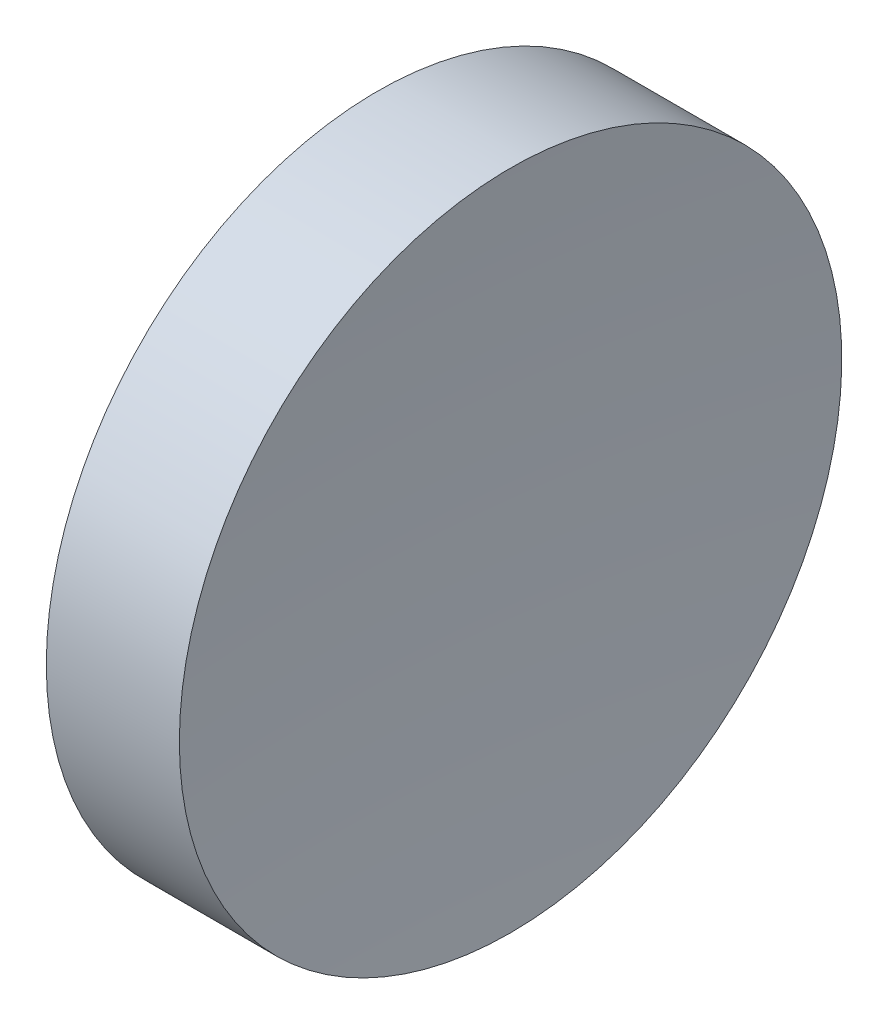
ISO-10303-21;
HEADER;
FILE_DESCRIPTION(('STEP AP214'),'2;1');
FILE_NAME('part.step','',(''),(''),'','','');
FILE_SCHEMA(('AUTOMOTIVE_DESIGN { 1 0 10303 214 1 1 1 1 }'));
ENDSEC;
DATA;
#1=APPLICATION_CONTEXT('core data for automotive mechanical design processes');
#2=APPLICATION_PROTOCOL_DEFINITION('international standard','automotive_design',2000,#1);
#3=PRODUCT_CONTEXT('',#1,'mechanical');
#4=PRODUCT('Part','Part','',(#3));
#5=PRODUCT_RELATED_PRODUCT_CATEGORY('part','',(#4));
#6=PRODUCT_DEFINITION_FORMATION('','',#4);
#7=PRODUCT_DEFINITION_CONTEXT('part definition',#1,'design');
#8=PRODUCT_DEFINITION('design','',#6,#7);
#9=PRODUCT_DEFINITION_SHAPE('','',#8);
#10=(LENGTH_UNIT() NAMED_UNIT(*) SI_UNIT(.MILLI.,.METRE.));
#11=(NAMED_UNIT(*) PLANE_ANGLE_UNIT() SI_UNIT($,.RADIAN.));
#12=(NAMED_UNIT(*) SI_UNIT($,.STERADIAN.) SOLID_ANGLE_UNIT());
#13=UNCERTAINTY_MEASURE_WITH_UNIT(LENGTH_MEASURE(1.E-05),#10,'distance_accuracy_value','');
#14=(GEOMETRIC_REPRESENTATION_CONTEXT(3) GLOBAL_UNCERTAINTY_ASSIGNED_CONTEXT((#13)) GLOBAL_UNIT_ASSIGNED_CONTEXT((#10,
#11,#12)) REPRESENTATION_CONTEXT('',''));
#15=CARTESIAN_POINT('',(0.,0.,0.));
#16=DIRECTION('',(0.,0.,1.));
#17=DIRECTION('',(1.,0.,0.));
#18=AXIS2_PLACEMENT_3D('',#15,#16,#17);
#19=CARTESIAN_POINT('',(539.185315801623,138.756042246745,0.));
#20=DIRECTION('',(-1.,0.,0.));
#21=DIRECTION('',(0.,-1.,0.));
#22=AXIS2_PLACEMENT_3D('',#19,#20,#21);
#23=SPHERICAL_SURFACE('',#22,300.);
#24=CARTESIAN_POINT('',(240.228797224088,138.756042246745,0.));
#25=DIRECTION('',(-1.,0.,0.));
#26=DIRECTION('',(0.,0.,1.));
#27=AXIS2_PLACEMENT_3D('',#24,#25,#26);
#28=CIRCLE('',#27,25.);
#29=CARTESIAN_POINT('',(240.228797224088,138.756042246745,25.));
#30=VERTEX_POINT('',#29);
#31=EDGE_CURVE('E10',#30,#30,#28,.T.);
#32=ORIENTED_EDGE('',*,*,#31,.F.);
#33=EDGE_LOOP('',(#32));
#34=FACE_BOUND('',#33,.T.);
#35=ADVANCED_FACE('F35',(#34),#23,.F.);
#36=CARTESIAN_POINT('',(217.97028600433,138.756042246745,0.));
#37=DIRECTION('',(-1.,0.,0.));
#38=DIRECTION('',(0.,0.,1.));
#39=AXIS2_PLACEMENT_3D('',#36,#37,#38);
#40=CYLINDRICAL_SURFACE('',#39,25.);
#41=CARTESIAN_POINT('',(230.185311069839,138.756042246745,0.));
#42=DIRECTION('',(-1.,0.,0.));
#43=DIRECTION('',(0.,0.,1.));
#44=AXIS2_PLACEMENT_3D('',#41,#42,#43);
#45=CIRCLE('',#44,25.);
#46=CARTESIAN_POINT('',(230.185311069839,138.756042246745,25.));
#47=VERTEX_POINT('',#46);
#48=EDGE_CURVE('E41',#47,#47,#45,.T.);
#49=ORIENTED_EDGE('',*,*,#48,.F.);
#50=EDGE_LOOP('',(#49));
#51=FACE_BOUND('',#50,.T.);
#52=ORIENTED_EDGE('',*,*,#31,.T.);
#53=EDGE_LOOP('',(#52));
#54=FACE_BOUND('',#53,.T.);
#55=ADVANCED_FACE('F49',(#51,#54),#40,.T.);
#56=CARTESIAN_POINT('',(230.185311069839,138.756042246745,0.));
#57=DIRECTION('',(1.,0.,0.));
#58=DIRECTION('',(0.,0.,-1.));
#59=AXIS2_PLACEMENT_3D('',#56,#57,#58);
#60=PLANE('',#59);
#61=ORIENTED_EDGE('',*,*,#48,.T.);
#62=EDGE_LOOP('',(#61));
#63=FACE_BOUND('',#62,.T.);
#64=ADVANCED_FACE('F47',(#63),#60,.F.);
#65=CLOSED_SHELL('',(#35,#55,#64));
#66=MANIFOLD_SOLID_BREP('B2',#65);
#67=ADVANCED_BREP_SHAPE_REPRESENTATION('',(#18,#66),#14);
#68=SHAPE_DEFINITION_REPRESENTATION(#9,#67);
ENDSEC;
END-ISO-10303-21;
